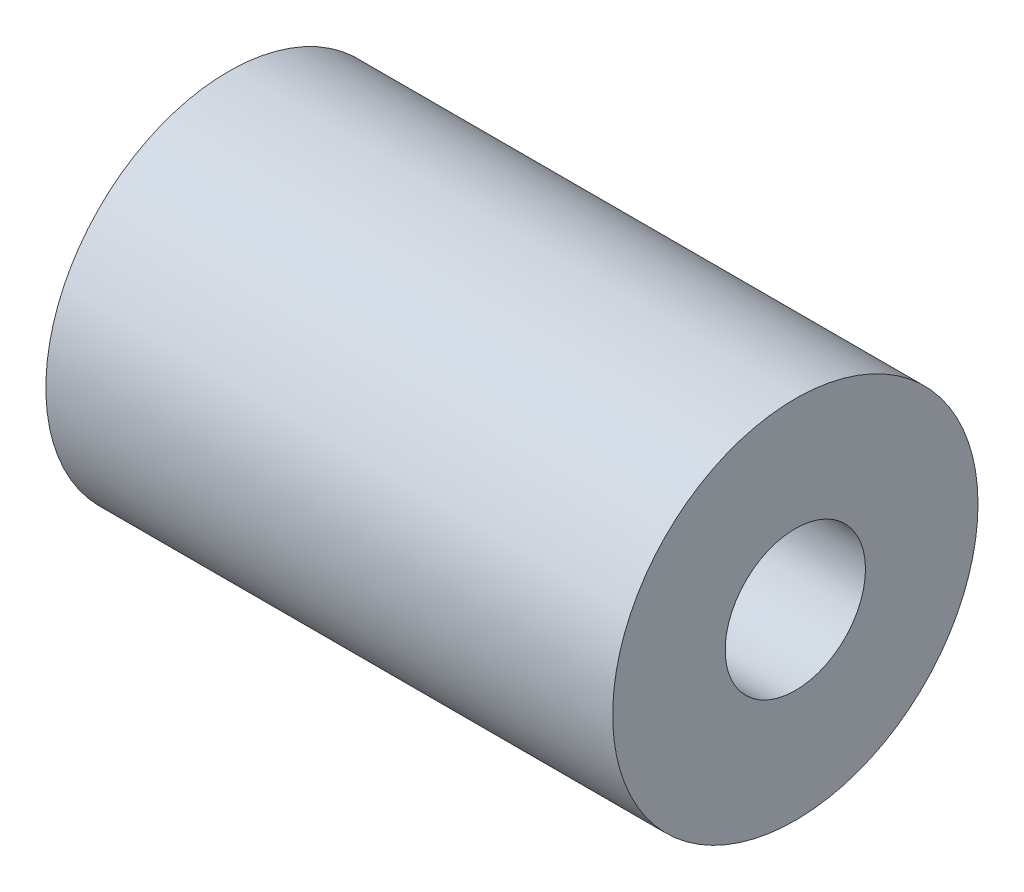
ISO-10303-21;
HEADER;
FILE_DESCRIPTION(('STEP AP214'),'2;1');
FILE_NAME('part.step','',(''),(''),'','','');
FILE_SCHEMA(('AUTOMOTIVE_DESIGN { 1 0 10303 214 1 1 1 1 }'));
ENDSEC;
DATA;
#1=APPLICATION_CONTEXT('core data for automotive mechanical design processes');
#2=APPLICATION_PROTOCOL_DEFINITION('international standard','automotive_design',2000,#1);
#3=PRODUCT_CONTEXT('',#1,'mechanical');
#4=PRODUCT('Part','Part','',(#3));
#5=PRODUCT_RELATED_PRODUCT_CATEGORY('part','',(#4));
#6=PRODUCT_DEFINITION_FORMATION('','',#4);
#7=PRODUCT_DEFINITION_CONTEXT('part definition',#1,'design');
#8=PRODUCT_DEFINITION('design','',#6,#7);
#9=PRODUCT_DEFINITION_SHAPE('','',#8);
#10=(LENGTH_UNIT() NAMED_UNIT(*) SI_UNIT(.MILLI.,.METRE.));
#11=(NAMED_UNIT(*) PLANE_ANGLE_UNIT() SI_UNIT($,.RADIAN.));
#12=(NAMED_UNIT(*) SI_UNIT($,.STERADIAN.) SOLID_ANGLE_UNIT());
#13=UNCERTAINTY_MEASURE_WITH_UNIT(LENGTH_MEASURE(1.E-05),#10,'distance_accuracy_value','');
#14=(GEOMETRIC_REPRESENTATION_CONTEXT(3) GLOBAL_UNCERTAINTY_ASSIGNED_CONTEXT((#13)) GLOBAL_UNIT_ASSIGNED_CONTEXT((#10,
#11,#12)) REPRESENTATION_CONTEXT('',''));
#15=CARTESIAN_POINT('',(0.,0.,0.));
#16=DIRECTION('',(0.,0.,1.));
#17=DIRECTION('',(1.,0.,0.));
#18=AXIS2_PLACEMENT_3D('',#15,#16,#17);
#19=CARTESIAN_POINT('',(12.827,0.,0.));
#20=DIRECTION('',(1.,0.,0.));
#21=DIRECTION('',(0.,0.,-1.));
#22=AXIS2_PLACEMENT_3D('',#19,#20,#21);
#23=PLANE('',#22);
#24=CARTESIAN_POINT('',(12.827,0.,0.));
#25=DIRECTION('',(1.,0.,0.));
#26=DIRECTION('',(0.,0.,-1.));
#27=AXIS2_PLACEMENT_3D('',#24,#25,#26);
#28=CIRCLE('',#27,8.2677);
#29=CARTESIAN_POINT('',(12.827,0.,-8.2677));
#30=VERTEX_POINT('',#29);
#31=EDGE_CURVE('E10',#30,#30,#28,.T.);
#32=ORIENTED_EDGE('',*,*,#31,.T.);
#33=EDGE_LOOP('',(#32));
#34=FACE_BOUND('',#33,.T.);
#35=CARTESIAN_POINT('',(12.827,0.,0.));
#36=DIRECTION('',(1.,0.,0.));
#37=DIRECTION('',(0.,0.,-1.));
#38=AXIS2_PLACEMENT_3D('',#35,#36,#37);
#39=CIRCLE('',#38,3.175);
#40=CARTESIAN_POINT('',(12.827,0.,-3.175));
#41=VERTEX_POINT('',#40);
#42=EDGE_CURVE('E42',#41,#41,#39,.T.);
#43=ORIENTED_EDGE('',*,*,#42,.F.);
#44=EDGE_LOOP('',(#43));
#45=FACE_BOUND('',#44,.T.);
#46=ADVANCED_FACE('F31',(#34,#45),#23,.T.);
#47=CARTESIAN_POINT('',(-12.827,0.,0.));
#48=DIRECTION('',(1.,0.,0.));
#49=DIRECTION('',(0.,0.,-1.));
#50=AXIS2_PLACEMENT_3D('',#47,#48,#49);
#51=PLANE('',#50);
#52=CARTESIAN_POINT('',(-12.827,0.,0.));
#53=DIRECTION('',(1.,0.,0.));
#54=DIRECTION('',(0.,0.,-1.));
#55=AXIS2_PLACEMENT_3D('',#52,#53,#54);
#56=CIRCLE('',#55,8.2677);
#57=CARTESIAN_POINT('',(-12.827,0.,-8.2677));
#58=VERTEX_POINT('',#57);
#59=EDGE_CURVE('E35',#58,#58,#56,.T.);
#60=ORIENTED_EDGE('',*,*,#59,.F.);
#61=EDGE_LOOP('',(#60));
#62=FACE_BOUND('',#61,.T.);
#63=CARTESIAN_POINT('',(-12.827,0.,0.));
#64=DIRECTION('',(1.,0.,0.));
#65=DIRECTION('',(0.,0.,-1.));
#66=AXIS2_PLACEMENT_3D('',#63,#64,#65);
#67=CIRCLE('',#66,3.175);
#68=CARTESIAN_POINT('',(-12.827,0.,-3.175));
#69=VERTEX_POINT('',#68);
#70=EDGE_CURVE('E44',#69,#69,#67,.T.);
#71=ORIENTED_EDGE('',*,*,#70,.T.);
#72=EDGE_LOOP('',(#71));
#73=FACE_BOUND('',#72,.T.);
#74=ADVANCED_FACE('F54',(#62,#73),#51,.F.);
#75=CARTESIAN_POINT('',(12.827,0.,0.));
#76=DIRECTION('',(-1.,0.,0.));
#77=DIRECTION('',(0.,0.,1.));
#78=AXIS2_PLACEMENT_3D('',#75,#76,#77);
#79=CYLINDRICAL_SURFACE('',#78,8.2677);
#80=ORIENTED_EDGE('',*,*,#31,.F.);
#81=EDGE_LOOP('',(#80));
#82=FACE_BOUND('',#81,.T.);
#83=ORIENTED_EDGE('',*,*,#59,.T.);
#84=EDGE_LOOP('',(#83));
#85=FACE_BOUND('',#84,.T.);
#86=ADVANCED_FACE('F33',(#82,#85),#79,.T.);
#87=CARTESIAN_POINT('',(12.827,0.,0.));
#88=DIRECTION('',(-1.,0.,0.));
#89=DIRECTION('',(0.,0.,1.));
#90=AXIS2_PLACEMENT_3D('',#87,#88,#89);
#91=CYLINDRICAL_SURFACE('',#90,3.175);
#92=ORIENTED_EDGE('',*,*,#42,.T.);
#93=EDGE_LOOP('',(#92));
#94=FACE_BOUND('',#93,.T.);
#95=ORIENTED_EDGE('',*,*,#70,.F.);
#96=EDGE_LOOP('',(#95));
#97=FACE_BOUND('',#96,.T.);
#98=ADVANCED_FACE('F50',(#94,#97),#91,.F.);
#99=CLOSED_SHELL('',(#46,#74,#86,#98));
#100=MANIFOLD_SOLID_BREP('B2',#99);
#101=ADVANCED_BREP_SHAPE_REPRESENTATION('',(#18,#100),#14);
#102=SHAPE_DEFINITION_REPRESENTATION(#9,#101);
ENDSEC;
END-ISO-10303-21;
